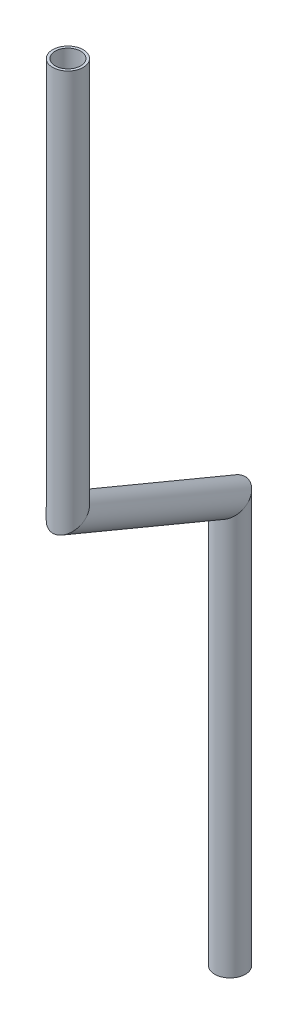
ISO-10303-21;
HEADER;
FILE_DESCRIPTION(('STEP AP214'),'2;1');
FILE_NAME('part.step','',(''),(''),'','','');
FILE_SCHEMA(('AUTOMOTIVE_DESIGN { 1 0 10303 214 1 1 1 1 }'));
ENDSEC;
DATA;
#1=APPLICATION_CONTEXT('core data for automotive mechanical design processes');
#2=APPLICATION_PROTOCOL_DEFINITION('international standard','automotive_design',2000,#1);
#3=PRODUCT_CONTEXT('',#1,'mechanical');
#4=PRODUCT('Part','Part','',(#3));
#5=PRODUCT_RELATED_PRODUCT_CATEGORY('part','',(#4));
#6=PRODUCT_DEFINITION_FORMATION('','',#4);
#7=PRODUCT_DEFINITION_CONTEXT('part definition',#1,'design');
#8=PRODUCT_DEFINITION('design','',#6,#7);
#9=PRODUCT_DEFINITION_SHAPE('','',#8);
#10=(LENGTH_UNIT() NAMED_UNIT(*) SI_UNIT(.MILLI.,.METRE.));
#11=(NAMED_UNIT(*) PLANE_ANGLE_UNIT() SI_UNIT($,.RADIAN.));
#12=(NAMED_UNIT(*) SI_UNIT($,.STERADIAN.) SOLID_ANGLE_UNIT());
#13=UNCERTAINTY_MEASURE_WITH_UNIT(LENGTH_MEASURE(1.E-05),#10,'distance_accuracy_value','');
#14=(GEOMETRIC_REPRESENTATION_CONTEXT(3) GLOBAL_UNCERTAINTY_ASSIGNED_CONTEXT((#13)) GLOBAL_UNIT_ASSIGNED_CONTEXT((#10,
#11,#12)) REPRESENTATION_CONTEXT('',''));
#15=CARTESIAN_POINT('',(0.,0.,0.));
#16=DIRECTION('',(0.,0.,1.));
#17=DIRECTION('',(1.,0.,0.));
#18=AXIS2_PLACEMENT_3D('',#15,#16,#17);
#19=CARTESIAN_POINT('',(-822.20453317785,-198.688949127323,344.151093015573));
#20=DIRECTION('',(0.,1.,0.));
#21=DIRECTION('',(0.,0.,1.));
#22=AXIS2_PLACEMENT_3D('',#19,#20,#21);
#23=CYLINDRICAL_SURFACE('',#22,5.28320000000004);
#24=CARTESIAN_POINT('',(-822.20453317785,-35.6588284012198,344.151093015573));
#25=DIRECTION('',(0.,-1.,0.));
#26=DIRECTION('',(0.,0.,-1.));
#27=AXIS2_PLACEMENT_3D('',#24,#25,#26);
#28=CIRCLE('',#27,5.28320000000004);
#29=CARTESIAN_POINT('',(-822.20453317785,-35.6588284012198,338.867893015573));
#30=VERTEX_POINT('',#29);
#31=EDGE_CURVE('E55',#30,#30,#28,.T.);
#32=ORIENTED_EDGE('',*,*,#31,.F.);
#33=EDGE_LOOP('',(#32));
#34=FACE_BOUND('',#33,.T.);
#35=CARTESIAN_POINT('',(-822.20453317785,-198.688949127323,344.151093015573));
#36=DIRECTION('',(-0.0215581054120804,-0.837199864920777,-0.546471988548063));
#37=DIRECTION('',(-0.0330015363076282,0.546897052631145,-0.836549169161445));
#38=AXIS2_PLACEMENT_3D('',#35,#36,#37);
#39=ELLIPSE('',#38,6.31056002439751,5.28320000000004);
#40=CARTESIAN_POINT('',(-822.412791353617,-195.237722449528,338.871999270219));
#41=VERTEX_POINT('',#40);
#42=EDGE_CURVE('E51',#41,#41,#39,.T.);
#43=ORIENTED_EDGE('',*,*,#42,.T.);
#44=EDGE_LOOP('',(#43));
#45=FACE_BOUND('',#44,.T.);
#46=ADVANCED_FACE('F47',(#34,#45),#23,.F.);
#47=CARTESIAN_POINT('',(-822.20453317785,-198.688949127323,344.151093015573));
#48=DIRECTION('',(0.,1.,0.));
#49=DIRECTION('',(0.,0.,1.));
#50=AXIS2_PLACEMENT_3D('',#47,#48,#49);
#51=CYLINDRICAL_SURFACE('',#50,6.35000000000005);
#52=CARTESIAN_POINT('',(-822.20453317785,-35.6588284012198,344.151093015573));
#53=DIRECTION('',(0.,-1.,0.));
#54=DIRECTION('',(0.,0.,-1.));
#55=AXIS2_PLACEMENT_3D('',#52,#53,#54);
#56=CIRCLE('',#55,6.35000000000005);
#57=CARTESIAN_POINT('',(-822.20453317785,-35.6588284012198,337.801093015573));
#58=VERTEX_POINT('',#57);
#59=EDGE_CURVE('E59',#58,#58,#56,.T.);
#60=ORIENTED_EDGE('',*,*,#59,.T.);
#61=EDGE_LOOP('',(#60));
#62=FACE_BOUND('',#61,.T.);
#63=CARTESIAN_POINT('',(-822.20453317785,-198.688949127323,344.151093015573));
#64=DIRECTION('',(-0.0215581054120804,-0.837199864920777,-0.546471988548063));
#65=DIRECTION('',(-0.0330015363076282,0.546897052631145,-0.836549169161445));
#66=AXIS2_PLACEMENT_3D('',#63,#64,#65);
#67=ELLIPSE('',#66,7.58480772163161,6.35000000000005);
#68=CARTESIAN_POINT('',(-822.454843485262,-194.540840139589,337.806028417792));
#69=VERTEX_POINT('',#68);
#70=EDGE_CURVE('E12',#69,#69,#67,.T.);
#71=ORIENTED_EDGE('',*,*,#70,.F.);
#72=EDGE_LOOP('',(#71));
#73=FACE_BOUND('',#72,.T.);
#74=ADVANCED_FACE('F74',(#62,#73),#51,.T.);
#75=CARTESIAN_POINT('',(-822.20453317785,-35.6588284012198,344.151093015573));
#76=DIRECTION('',(0.,-1.,0.));
#77=DIRECTION('',(0.,0.,-1.));
#78=AXIS2_PLACEMENT_3D('',#75,#76,#77);
#79=PLANE('',#78);
#80=ORIENTED_EDGE('',*,*,#31,.T.);
#81=EDGE_LOOP('',(#80));
#82=FACE_BOUND('',#81,.T.);
#83=ORIENTED_EDGE('',*,*,#59,.F.);
#84=EDGE_LOOP('',(#83));
#85=FACE_BOUND('',#84,.T.);
#86=ADVANCED_FACE('F70',(#82,#85),#79,.F.);
#87=CARTESIAN_POINT('',(-822.20453317785,-198.688949127323,344.151093015573));
#88=DIRECTION('',(-0.0215581054120804,-0.837199864920777,-0.546471988548063));
#89=DIRECTION('',(0.,0.546599019778219,-0.837394477876162));
#90=AXIS2_PLACEMENT_3D('',#87,#88,#89);
#91=PLANE('',#90);
#92=ORIENTED_EDGE('',*,*,#42,.F.);
#93=EDGE_LOOP('',(#92));
#94=FACE_BOUND('',#93,.T.);
#95=ORIENTED_EDGE('',*,*,#70,.T.);
#96=EDGE_LOOP('',(#95));
#97=FACE_BOUND('',#96,.T.);
#98=ADVANCED_FACE('F49',(#94,#97),#91,.T.);
#99=CLOSED_SHELL('',(#46,#74,#86,#98));
#100=MANIFOLD_SOLID_BREP('B2',#99);
#101=CARTESIAN_POINT('',(-824.964556296569,-229.411744476627,274.187833568857));
#102=DIRECTION('',(0.0360968858778831,0.401807227646734,0.915012549990854));
#103=DIRECTION('',(0.,-0.915609257071108,0.402069258170398));
#104=AXIS2_PLACEMENT_3D('',#101,#102,#103);
#105=CYLINDRICAL_SURFACE('',#104,5.28320000000004);
#106=CARTESIAN_POINT('',(-824.964556296569,-229.411744476627,274.187833568857));
#107=DIRECTION('',(-0.0215581054120804,-0.837199864920777,-0.546471988548063));
#108=DIRECTION('',(0.0330015363076281,-0.546897052631145,0.836549169161445));
#109=AXIS2_PLACEMENT_3D('',#106,#107,#108);
#110=ELLIPSE('',#109,6.3105600243975,5.28320000000004);
#111=CARTESIAN_POINT('',(-824.756298120802,-232.862971154422,279.46692731421));
#112=VERTEX_POINT('',#111);
#113=EDGE_CURVE('E150',#112,#112,#110,.T.);
#114=ORIENTED_EDGE('',*,*,#113,.T.);
#115=EDGE_LOOP('',(#114));
#116=FACE_BOUND('',#115,.T.);
#117=CARTESIAN_POINT('',(-822.20453317785,-198.688949127323,344.151093015573));
#118=DIRECTION('',(0.0215581054120804,0.837199864920777,0.546471988548063));
#119=DIRECTION('',(0.0330015363076281,-0.546897052631145,0.836549169161445));
#120=AXIS2_PLACEMENT_3D('',#117,#118,#119);
#121=ELLIPSE('',#120,6.3105600243975,5.28320000000004);
#122=CARTESIAN_POINT('',(-821.996275002083,-202.140175805118,349.430186760926));
#123=VERTEX_POINT('',#122);
#124=EDGE_CURVE('E140',#123,#123,#121,.T.);
#125=ORIENTED_EDGE('',*,*,#124,.T.);
#126=EDGE_LOOP('',(#125));
#127=FACE_BOUND('',#126,.T.);
#128=ADVANCED_FACE('F136',(#116,#127),#105,.F.);
#129=CARTESIAN_POINT('',(-824.964556296569,-229.411744476627,274.187833568857));
#130=DIRECTION('',(0.0360968858778831,0.401807227646734,0.915012549990854));
#131=DIRECTION('',(0.,-0.915609257071108,0.402069258170398));
#132=AXIS2_PLACEMENT_3D('',#129,#130,#131);
#133=CYLINDRICAL_SURFACE('',#132,6.35000000000005);
#134=CARTESIAN_POINT('',(-824.964556296569,-229.411744476627,274.187833568857));
#135=DIRECTION('',(-0.0215581054120804,-0.837199864920777,-0.546471988548063));
#136=DIRECTION('',(0.0330015363076281,-0.546897052631145,0.836549169161445));
#137=AXIS2_PLACEMENT_3D('',#134,#135,#136);
#138=ELLIPSE('',#137,7.58480772163161,6.35000000000005);
#139=CARTESIAN_POINT('',(-824.714245989157,-233.559853464362,280.532898166637));
#140=VERTEX_POINT('',#139);
#141=EDGE_CURVE('E144',#140,#140,#138,.T.);
#142=ORIENTED_EDGE('',*,*,#141,.F.);
#143=EDGE_LOOP('',(#142));
#144=FACE_BOUND('',#143,.T.);
#145=CARTESIAN_POINT('',(-822.20453317785,-198.688949127323,344.151093015573));
#146=DIRECTION('',(0.0215581054120804,0.837199864920777,0.546471988548063));
#147=DIRECTION('',(0.0330015363076281,-0.546897052631145,0.836549169161445));
#148=AXIS2_PLACEMENT_3D('',#145,#146,#147);
#149=ELLIPSE('',#148,7.58480772163161,6.35000000000005);
#150=CARTESIAN_POINT('',(-821.954222870438,-202.837058115058,350.496157613353));
#151=VERTEX_POINT('',#150);
#152=EDGE_CURVE('E46',#151,#151,#149,.T.);
#153=ORIENTED_EDGE('',*,*,#152,.F.);
#154=EDGE_LOOP('',(#153));
#155=FACE_BOUND('',#154,.T.);
#156=ADVANCED_FACE('F163',(#144,#155),#133,.T.);
#157=CARTESIAN_POINT('',(-824.964556296569,-229.411744476627,274.187833568857));
#158=DIRECTION('',(-0.0215581054120804,-0.837199864920777,-0.546471988548063));
#159=DIRECTION('',(0.,0.546599019778219,-0.837394477876162));
#160=AXIS2_PLACEMENT_3D('',#157,#158,#159);
#161=PLANE('',#160);
#162=ORIENTED_EDGE('',*,*,#113,.F.);
#163=EDGE_LOOP('',(#162));
#164=FACE_BOUND('',#163,.T.);
#165=ORIENTED_EDGE('',*,*,#141,.T.);
#166=EDGE_LOOP('',(#165));
#167=FACE_BOUND('',#166,.T.);
#168=ADVANCED_FACE('F159',(#164,#167),#161,.T.);
#169=CARTESIAN_POINT('',(-822.20453317785,-198.688949127323,344.151093015573));
#170=DIRECTION('',(0.0215581054120804,0.837199864920777,0.546471988548063));
#171=DIRECTION('',(0.,-0.546599019778219,0.837394477876162));
#172=AXIS2_PLACEMENT_3D('',#169,#170,#171);
#173=PLANE('',#172);
#174=ORIENTED_EDGE('',*,*,#124,.F.);
#175=EDGE_LOOP('',(#174));
#176=FACE_BOUND('',#175,.T.);
#177=ORIENTED_EDGE('',*,*,#152,.T.);
#178=EDGE_LOOP('',(#177));
#179=FACE_BOUND('',#178,.T.);
#180=ADVANCED_FACE('F138',(#176,#179),#173,.T.);
#181=CLOSED_SHELL('',(#128,#156,#168,#180));
#182=MANIFOLD_SOLID_BREP('B7',#181);
#183=CARTESIAN_POINT('',(-824.964556296566,-397.526501206854,274.187833568862));
#184=DIRECTION('',(0.,1.,0.));
#185=DIRECTION('',(0.,0.,1.));
#186=AXIS2_PLACEMENT_3D('',#183,#184,#185);
#187=CYLINDRICAL_SURFACE('',#186,5.28320000000004);
#188=CARTESIAN_POINT('',(-824.964556296566,-397.526501206854,274.187833568862));
#189=DIRECTION('',(0.,-1.,0.));
#190=DIRECTION('',(0.,0.,-1.));
#191=AXIS2_PLACEMENT_3D('',#188,#189,#190);
#192=CIRCLE('',#191,5.28320000000004);
#193=CARTESIAN_POINT('',(-824.964556296566,-397.526501206854,268.904633568862));
#194=VERTEX_POINT('',#193);
#195=EDGE_CURVE('E234',#194,#194,#192,.T.);
#196=ORIENTED_EDGE('',*,*,#195,.T.);
#197=EDGE_LOOP('',(#196));
#198=FACE_BOUND('',#197,.T.);
#199=CARTESIAN_POINT('',(-824.964556296567,-229.41174447663,274.187833568861));
#200=DIRECTION('',(0.0215581054120804,0.837199864920777,0.546471988548063));
#201=DIRECTION('',(-0.033001536307642,0.546897052631145,-0.836549169161444));
#202=AXIS2_PLACEMENT_3D('',#199,#200,#201);
#203=ELLIPSE('',#202,6.31056002439754,5.28320000000004);
#204=CARTESIAN_POINT('',(-825.172814472334,-225.960517798835,268.908739823508));
#205=VERTEX_POINT('',#204);
#206=EDGE_CURVE('E224',#205,#205,#203,.T.);
#207=ORIENTED_EDGE('',*,*,#206,.T.);
#208=EDGE_LOOP('',(#207));
#209=FACE_BOUND('',#208,.T.);
#210=ADVANCED_FACE('F220',(#198,#209),#187,.F.);
#211=CARTESIAN_POINT('',(-824.964556296566,-397.526501206854,274.187833568862));
#212=DIRECTION('',(0.,1.,0.));
#213=DIRECTION('',(0.,0.,1.));
#214=AXIS2_PLACEMENT_3D('',#211,#212,#213);
#215=CYLINDRICAL_SURFACE('',#214,6.35000000000005);
#216=CARTESIAN_POINT('',(-824.964556296566,-397.526501206854,274.187833568862));
#217=DIRECTION('',(0.,-1.,0.));
#218=DIRECTION('',(0.,0.,-1.));
#219=AXIS2_PLACEMENT_3D('',#216,#217,#218);
#220=CIRCLE('',#219,6.35000000000005);
#221=CARTESIAN_POINT('',(-824.964556296566,-397.526501206854,267.837833568862));
#222=VERTEX_POINT('',#221);
#223=EDGE_CURVE('E228',#222,#222,#220,.T.);
#224=ORIENTED_EDGE('',*,*,#223,.F.);
#225=EDGE_LOOP('',(#224));
#226=FACE_BOUND('',#225,.T.);
#227=CARTESIAN_POINT('',(-824.964556296567,-229.41174447663,274.187833568861));
#228=DIRECTION('',(0.0215581054120804,0.837199864920777,0.546471988548063));
#229=DIRECTION('',(-0.033001536307642,0.546897052631145,-0.836549169161444));
#230=AXIS2_PLACEMENT_3D('',#227,#228,#229);
#231=ELLIPSE('',#230,7.58480772163165,6.35000000000005);
#232=CARTESIAN_POINT('',(-825.214866603979,-225.263635488895,267.842768971081));
#233=VERTEX_POINT('',#232);
#234=EDGE_CURVE('E135',#233,#233,#231,.T.);
#235=ORIENTED_EDGE('',*,*,#234,.F.);
#236=EDGE_LOOP('',(#235));
#237=FACE_BOUND('',#236,.T.);
#238=ADVANCED_FACE('F247',(#226,#237),#215,.T.);
#239=CARTESIAN_POINT('',(-824.964556296566,-397.526501206854,274.187833568862));
#240=DIRECTION('',(0.,-1.,0.));
#241=DIRECTION('',(0.,0.,-1.));
#242=AXIS2_PLACEMENT_3D('',#239,#240,#241);
#243=PLANE('',#242);
#244=ORIENTED_EDGE('',*,*,#195,.F.);
#245=EDGE_LOOP('',(#244));
#246=FACE_BOUND('',#245,.T.);
#247=ORIENTED_EDGE('',*,*,#223,.T.);
#248=EDGE_LOOP('',(#247));
#249=FACE_BOUND('',#248,.T.);
#250=ADVANCED_FACE('F243',(#246,#249),#243,.T.);
#251=CARTESIAN_POINT('',(-824.964556296569,-229.411744476627,274.187833568857));
#252=DIRECTION('',(0.0215581054120804,0.837199864920777,0.546471988548063));
#253=DIRECTION('',(0.,-0.546599019778219,0.837394477876162));
#254=AXIS2_PLACEMENT_3D('',#251,#252,#253);
#255=PLANE('',#254);
#256=ORIENTED_EDGE('',*,*,#206,.F.);
#257=EDGE_LOOP('',(#256));
#258=FACE_BOUND('',#257,.T.);
#259=ORIENTED_EDGE('',*,*,#234,.T.);
#260=EDGE_LOOP('',(#259));
#261=FACE_BOUND('',#260,.T.);
#262=ADVANCED_FACE('F222',(#258,#261),#255,.T.);
#263=CLOSED_SHELL('',(#210,#238,#250,#262));
#264=MANIFOLD_SOLID_BREP('B41',#263);
#265=ADVANCED_BREP_SHAPE_REPRESENTATION('',(#18,#100,#182,#264),#14);
#266=SHAPE_DEFINITION_REPRESENTATION(#9,#265);
ENDSEC;
END-ISO-10303-21;
